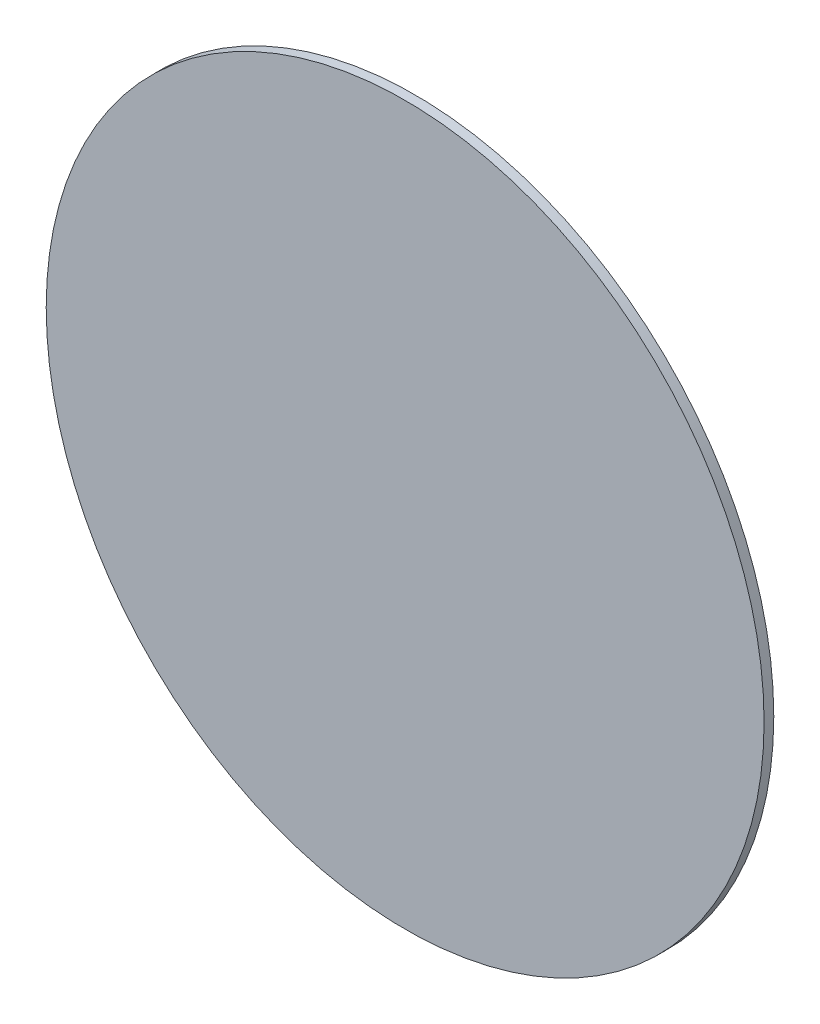
ISO-10303-21;
HEADER;
FILE_DESCRIPTION(('STEP AP214'),'2;1');
FILE_NAME('part.step','',(''),(''),'','','');
FILE_SCHEMA(('AUTOMOTIVE_DESIGN { 1 0 10303 214 1 1 1 1 }'));
ENDSEC;
DATA;
#1=APPLICATION_CONTEXT('core data for automotive mechanical design processes');
#2=APPLICATION_PROTOCOL_DEFINITION('international standard','automotive_design',2000,#1);
#3=PRODUCT_CONTEXT('',#1,'mechanical');
#4=PRODUCT('Part','Part','',(#3));
#5=PRODUCT_RELATED_PRODUCT_CATEGORY('part','',(#4));
#6=PRODUCT_DEFINITION_FORMATION('','',#4);
#7=PRODUCT_DEFINITION_CONTEXT('part definition',#1,'design');
#8=PRODUCT_DEFINITION('design','',#6,#7);
#9=PRODUCT_DEFINITION_SHAPE('','',#8);
#10=(LENGTH_UNIT() NAMED_UNIT(*) SI_UNIT(.MILLI.,.METRE.));
#11=(NAMED_UNIT(*) PLANE_ANGLE_UNIT() SI_UNIT($,.RADIAN.));
#12=(NAMED_UNIT(*) SI_UNIT($,.STERADIAN.) SOLID_ANGLE_UNIT());
#13=UNCERTAINTY_MEASURE_WITH_UNIT(LENGTH_MEASURE(1.E-05),#10,'distance_accuracy_value','');
#14=(GEOMETRIC_REPRESENTATION_CONTEXT(3) GLOBAL_UNCERTAINTY_ASSIGNED_CONTEXT((#13)) GLOBAL_UNIT_ASSIGNED_CONTEXT((#10,
#11,#12)) REPRESENTATION_CONTEXT('',''));
#15=CARTESIAN_POINT('',(0.,0.,0.));
#16=DIRECTION('',(0.,0.,1.));
#17=DIRECTION('',(1.,0.,0.));
#18=AXIS2_PLACEMENT_3D('',#15,#16,#17);
#19=CARTESIAN_POINT('',(0.,0.,0.));
#20=DIRECTION('',(0.,0.,1.));
#21=DIRECTION('',(1.,0.,0.));
#22=AXIS2_PLACEMENT_3D('',#19,#20,#21);
#23=CYLINDRICAL_SURFACE('',#22,74.);
#24=CARTESIAN_POINT('',(0.,0.,0.));
#25=DIRECTION('',(0.,0.,1.));
#26=DIRECTION('',(1.,0.,0.));
#27=AXIS2_PLACEMENT_3D('',#24,#25,#26);
#28=CIRCLE('',#27,74.);
#29=CARTESIAN_POINT('',(74.,0.,0.));
#30=VERTEX_POINT('',#29);
#31=EDGE_CURVE('E10',#30,#30,#28,.T.);
#32=ORIENTED_EDGE('',*,*,#31,.F.);
#33=EDGE_LOOP('',(#32));
#34=FACE_BOUND('',#33,.T.);
#35=CARTESIAN_POINT('',(0.,0.,-2.));
#36=DIRECTION('',(0.,0.,1.));
#37=DIRECTION('',(1.,0.,0.));
#38=AXIS2_PLACEMENT_3D('',#35,#36,#37);
#39=CIRCLE('',#38,74.);
#40=CARTESIAN_POINT('',(74.,0.,-2.));
#41=VERTEX_POINT('',#40);
#42=EDGE_CURVE('E38',#41,#41,#39,.T.);
#43=ORIENTED_EDGE('',*,*,#42,.T.);
#44=EDGE_LOOP('',(#43));
#45=FACE_BOUND('',#44,.T.);
#46=ADVANCED_FACE('F35',(#34,#45),#23,.T.);
#47=CARTESIAN_POINT('',(0.,0.,0.));
#48=DIRECTION('',(0.,0.,1.));
#49=DIRECTION('',(1.,0.,0.));
#50=AXIS2_PLACEMENT_3D('',#47,#48,#49);
#51=PLANE('',#50);
#52=ORIENTED_EDGE('',*,*,#31,.T.);
#53=EDGE_LOOP('',(#52));
#54=FACE_BOUND('',#53,.T.);
#55=ADVANCED_FACE('F50',(#54),#51,.T.);
#56=CARTESIAN_POINT('',(0.,0.,-2.));
#57=DIRECTION('',(0.,0.,1.));
#58=DIRECTION('',(1.,0.,0.));
#59=AXIS2_PLACEMENT_3D('',#56,#57,#58);
#60=PLANE('',#59);
#61=ORIENTED_EDGE('',*,*,#42,.F.);
#62=EDGE_LOOP('',(#61));
#63=FACE_BOUND('',#62,.T.);
#64=ADVANCED_FACE('F48',(#63),#60,.F.);
#65=CLOSED_SHELL('',(#46,#55,#64));
#66=MANIFOLD_SOLID_BREP('B2',#65);
#67=ADVANCED_BREP_SHAPE_REPRESENTATION('',(#18,#66),#14);
#68=SHAPE_DEFINITION_REPRESENTATION(#9,#67);
ENDSEC;
END-ISO-10303-21;
